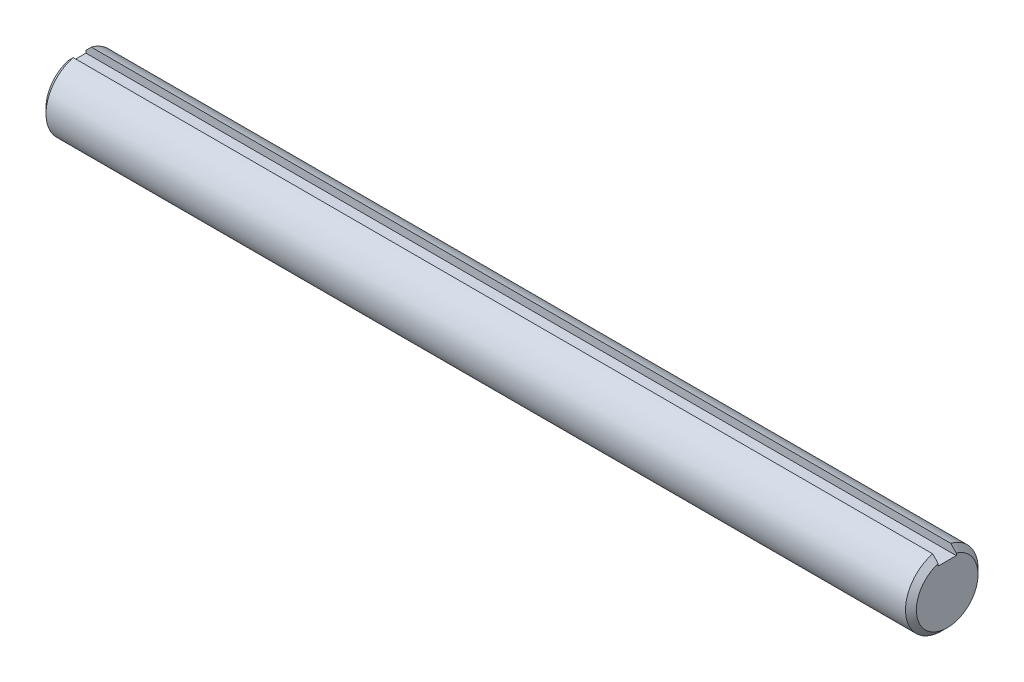
ISO-10303-21;
HEADER;
FILE_DESCRIPTION(('STEP AP214'),'2;1');
FILE_NAME('part.step','',(''),(''),'','','');
FILE_SCHEMA(('AUTOMOTIVE_DESIGN { 1 0 10303 214 1 1 1 1 }'));
ENDSEC;
DATA;
#1=APPLICATION_CONTEXT('core data for automotive mechanical design processes');
#2=APPLICATION_PROTOCOL_DEFINITION('international standard','automotive_design',2000,#1);
#3=PRODUCT_CONTEXT('',#1,'mechanical');
#4=PRODUCT('Part','Part','',(#3));
#5=PRODUCT_RELATED_PRODUCT_CATEGORY('part','',(#4));
#6=PRODUCT_DEFINITION_FORMATION('','',#4);
#7=PRODUCT_DEFINITION_CONTEXT('part definition',#1,'design');
#8=PRODUCT_DEFINITION('design','',#6,#7);
#9=PRODUCT_DEFINITION_SHAPE('','',#8);
#10=(LENGTH_UNIT() NAMED_UNIT(*) SI_UNIT(.MILLI.,.METRE.));
#11=(NAMED_UNIT(*) PLANE_ANGLE_UNIT() SI_UNIT($,.RADIAN.));
#12=(NAMED_UNIT(*) SI_UNIT($,.STERADIAN.) SOLID_ANGLE_UNIT());
#13=UNCERTAINTY_MEASURE_WITH_UNIT(LENGTH_MEASURE(1.E-05),#10,'distance_accuracy_value','');
#14=(GEOMETRIC_REPRESENTATION_CONTEXT(3) GLOBAL_UNCERTAINTY_ASSIGNED_CONTEXT((#13)) GLOBAL_UNIT_ASSIGNED_CONTEXT((#10,
#11,#12)) REPRESENTATION_CONTEXT('',''));
#15=CARTESIAN_POINT('',(0.,0.,0.));
#16=DIRECTION('',(0.,0.,1.));
#17=DIRECTION('',(1.,0.,0.));
#18=AXIS2_PLACEMENT_3D('',#15,#16,#17);
#19=CARTESIAN_POINT('',(152.4,0.,0.));
#20=DIRECTION('',(-1.,0.,0.));
#21=DIRECTION('',(0.,0.,1.));
#22=AXIS2_PLACEMENT_3D('',#19,#20,#21);
#23=CYLINDRICAL_SURFACE('',#22,12.7);
#24=CARTESIAN_POINT('',(150.495,0.,0.));
#25=DIRECTION('',(1.,0.,0.));
#26=DIRECTION('',(0.,0.,-1.));
#27=AXIS2_PLACEMENT_3D('',#24,#25,#26);
#28=CIRCLE('',#27,12.7);
#29=CARTESIAN_POINT('',(150.495,12.2967221242085,-3.17500000000001));
#30=VERTEX_POINT('',#29);
#31=CARTESIAN_POINT('',(150.495,12.2967221242085,3.17500000000001));
#32=VERTEX_POINT('',#31);
#33=EDGE_CURVE('E154',#30,#32,#28,.F.);
#34=ORIENTED_EDGE('',*,*,#33,.T.);
#35=DIRECTION('',(-1.,0.,0.));
#36=VECTOR('',#35,1.);
#37=CARTESIAN_POINT('',(152.4,12.2967221242085,3.17500000000001));
#38=LINE('',#37,#36);
#39=CARTESIAN_POINT('',(-150.495,12.2967221242085,3.17500000000001));
#40=VERTEX_POINT('',#39);
#41=EDGE_CURVE('E132',#32,#40,#38,.T.);
#42=ORIENTED_EDGE('',*,*,#41,.T.);
#43=CARTESIAN_POINT('',(-150.495,0.,0.));
#44=DIRECTION('',(1.,0.,0.));
#45=DIRECTION('',(0.,0.,-1.));
#46=AXIS2_PLACEMENT_3D('',#43,#44,#45);
#47=CIRCLE('',#46,12.7);
#48=CARTESIAN_POINT('',(-150.495,12.2967221242085,-3.17500000000001));
#49=VERTEX_POINT('',#48);
#50=EDGE_CURVE('E151',#40,#49,#47,.T.);
#51=ORIENTED_EDGE('',*,*,#50,.T.);
#52=DIRECTION('',(-1.,0.,0.));
#53=VECTOR('',#52,1.);
#54=CARTESIAN_POINT('',(152.4,12.2967221242085,-3.17500000000001));
#55=LINE('',#54,#53);
#56=EDGE_CURVE('E122',#49,#30,#55,.F.);
#57=ORIENTED_EDGE('',*,*,#56,.T.);
#58=EDGE_LOOP('',(#34,#42,#51,#57));
#59=FACE_BOUND('',#58,.T.);
#60=ADVANCED_FACE('F37',(#59),#23,.T.);
#61=CARTESIAN_POINT('',(152.4,0.,0.));
#62=DIRECTION('',(1.,0.,0.));
#63=DIRECTION('',(0.,0.,-1.));
#64=AXIS2_PLACEMENT_3D('',#61,#62,#63);
#65=PLANE('',#64);
#66=DIRECTION('',(0.,-1.,0.));
#67=VECTOR('',#66,1.);
#68=CARTESIAN_POINT('',(152.4,12.7,3.17500000000001));
#69=LINE('',#68,#67);
#70=CARTESIAN_POINT('',(152.4,10.3175287738877,3.17500000000001));
#71=VERTEX_POINT('',#70);
#72=CARTESIAN_POINT('',(152.4,9.525,3.17500000000001));
#73=VERTEX_POINT('',#72);
#74=EDGE_CURVE('E92',#71,#73,#69,.T.);
#75=ORIENTED_EDGE('',*,*,#74,.F.);
#76=CARTESIAN_POINT('',(152.4,0.,0.));
#77=DIRECTION('',(1.,0.,0.));
#78=DIRECTION('',(0.,0.,-1.));
#79=AXIS2_PLACEMENT_3D('',#76,#77,#78);
#80=CIRCLE('',#79,10.7950000000001);
#81=CARTESIAN_POINT('',(152.4,10.3175287738877,-3.17500000000001));
#82=VERTEX_POINT('',#81);
#83=EDGE_CURVE('E146',#71,#82,#80,.T.);
#84=ORIENTED_EDGE('',*,*,#83,.T.);
#85=DIRECTION('',(0.,1.,0.));
#86=VECTOR('',#85,1.);
#87=CARTESIAN_POINT('',(152.4,12.7,-3.17500000000001));
#88=LINE('',#87,#86);
#89=CARTESIAN_POINT('',(152.4,9.525,-3.17500000000001));
#90=VERTEX_POINT('',#89);
#91=EDGE_CURVE('E57',#90,#82,#88,.T.);
#92=ORIENTED_EDGE('',*,*,#91,.F.);
#93=DIRECTION('',(0.,0.,-1.));
#94=VECTOR('',#93,1.);
#95=CARTESIAN_POINT('',(152.4,9.525,3.17500000000001));
#96=LINE('',#95,#94);
#97=EDGE_CURVE('E102',#73,#90,#96,.T.);
#98=ORIENTED_EDGE('',*,*,#97,.F.);
#99=EDGE_LOOP('',(#75,#84,#92,#98));
#100=FACE_BOUND('',#99,.T.);
#101=ADVANCED_FACE('F113',(#100),#65,.T.);
#102=CARTESIAN_POINT('',(-152.4,0.,0.));
#103=DIRECTION('',(1.,0.,0.));
#104=DIRECTION('',(0.,0.,-1.));
#105=AXIS2_PLACEMENT_3D('',#102,#103,#104);
#106=PLANE('',#105);
#107=CARTESIAN_POINT('',(-152.4,0.,0.));
#108=DIRECTION('',(1.,0.,0.));
#109=DIRECTION('',(0.,0.,-1.));
#110=AXIS2_PLACEMENT_3D('',#107,#108,#109);
#111=CIRCLE('',#110,10.7949999999998);
#112=CARTESIAN_POINT('',(-152.4,10.3175287738874,-3.17500000000001));
#113=VERTEX_POINT('',#112);
#114=CARTESIAN_POINT('',(-152.4,10.3175287738874,3.17500000000001));
#115=VERTEX_POINT('',#114);
#116=EDGE_CURVE('E148',#113,#115,#111,.F.);
#117=ORIENTED_EDGE('',*,*,#116,.T.);
#118=DIRECTION('',(0.,-1.,0.));
#119=VECTOR('',#118,1.);
#120=CARTESIAN_POINT('',(-152.4,12.7,3.17500000000001));
#121=LINE('',#120,#119);
#122=CARTESIAN_POINT('',(-152.4,9.525,3.17500000000001));
#123=VERTEX_POINT('',#122);
#124=EDGE_CURVE('E115',#115,#123,#121,.T.);
#125=ORIENTED_EDGE('',*,*,#124,.T.);
#126=DIRECTION('',(0.,0.,-1.));
#127=VECTOR('',#126,1.);
#128=CARTESIAN_POINT('',(-152.4,9.525,3.17500000000001));
#129=LINE('',#128,#127);
#130=CARTESIAN_POINT('',(-152.4,9.525,-3.17500000000001));
#131=VERTEX_POINT('',#130);
#132=EDGE_CURVE('E108',#123,#131,#129,.T.);
#133=ORIENTED_EDGE('',*,*,#132,.T.);
#134=DIRECTION('',(0.,1.,0.));
#135=VECTOR('',#134,1.);
#136=CARTESIAN_POINT('',(-152.4,12.7,-3.17500000000001));
#137=LINE('',#136,#135);
#138=EDGE_CURVE('E111',#131,#113,#137,.T.);
#139=ORIENTED_EDGE('',*,*,#138,.T.);
#140=EDGE_LOOP('',(#117,#125,#133,#139));
#141=FACE_BOUND('',#140,.T.);
#142=ADVANCED_FACE('F165',(#141),#106,.F.);
#143=CARTESIAN_POINT('',(-150.495,0.,0.));
#144=DIRECTION('',(1.,0.,0.));
#145=DIRECTION('',(0.,0.,-1.));
#146=AXIS2_PLACEMENT_3D('',#143,#144,#145);
#147=CONICAL_SURFACE('',#146,12.7,0.785398163397451);
#148=CARTESIAN_POINT('',(-157.264196502013,5.0093717302407,3.17500000000001));
#149=CARTESIAN_POINT('',(-157.1667945387,5.12467963968378,3.17500000000001));
#150=CARTESIAN_POINT('',(-157.068842207621,5.23951989911784,3.17500000000001));
#151=CARTESIAN_POINT('',(-156.871992737128,5.46838421759484,3.17500000000001));
#152=CARTESIAN_POINT('',(-156.773095616323,5.58240829263705,3.17500000000001));
#153=CARTESIAN_POINT('',(-156.475230081458,5.92342458066591,3.17500000000001));
#154=CARTESIAN_POINT('',(-156.275072821867,6.14937813584766,3.17500000000001));
#155=CARTESIAN_POINT('',(-155.872467988588,6.59915683005551,3.17500000000001));
#156=CARTESIAN_POINT('',(-155.670020829871,6.82298234160729,3.17500000000001));
#157=CARTESIAN_POINT('',(-155.263355753249,7.26902629652594,3.17500000000001));
#158=CARTESIAN_POINT('',(-155.059137796434,7.49124470438244,3.17500000000001));
#159=CARTESIAN_POINT('',(-154.64938413778,7.93435772993712,3.17500000000001));
#160=CARTESIAN_POINT('',(-154.443848782028,8.15525266801075,3.17500000000001));
#161=CARTESIAN_POINT('',(-154.03169367339,8.5960245703693,3.17500000000001));
#162=CARTESIAN_POINT('',(-153.825073928935,8.81590154254229,3.17500000000001));
#163=CARTESIAN_POINT('',(-153.203892591144,9.47432927903637,3.17500000000001));
#164=CARTESIAN_POINT('',(-152.788030879735,9.91165318678529,3.17500000000001));
#165=CARTESIAN_POINT('',(-151.954096072104,10.7839479781506,3.17500000000001));
#166=CARTESIAN_POINT('',(-151.536023629402,11.2189194878173,3.17500000000001));
#167=CARTESIAN_POINT('',(-150.698229340112,12.0872516822017,3.17500000000001));
#168=CARTESIAN_POINT('',(-150.278507530402,12.5206124025178,3.17500000000001));
#169=CARTESIAN_POINT('',(-149.437764706775,13.3862448514882,3.17500000000001));
#170=CARTESIAN_POINT('',(-149.016743442379,13.8185163366833,3.17500000000001));
#171=CARTESIAN_POINT('',(-148.173758006437,14.682154105112,3.17500000000001));
#172=CARTESIAN_POINT('',(-147.751793818291,15.1135203721463,3.17500000000001));
#173=CARTESIAN_POINT('',(-147.329500629925,15.5445632058881,3.17500000000001));
#174=B_SPLINE_CURVE_WITH_KNOTS('',3,(#148,#149,#150,#151,#152,#153,#154,#155,#156,#157,#158,
#159,#160,#161,#162,#163,#164,#165,#166,#167,#168,#169,#170,#171,#172,#173),.UNSPECIFIED.,.F.,
.F.,(4,2,2,2,2,2,2,2,2,2,2,2,4),(0.,0.452816810908755,0.905624721024864,1.81117254191706,
2.71655880973217,3.62196502210454,4.52714240548241,5.43231276298766,7.24275040676511,
9.05267984842248,10.8625690499397,12.6728321405143,14.4831273549283),.UNSPECIFIED.);
#175=EDGE_CURVE('E65',#115,#40,#174,.T.);
#176=ORIENTED_EDGE('',*,*,#175,.F.);
#177=ORIENTED_EDGE('',*,*,#116,.F.);
#178=CARTESIAN_POINT('',(-147.329500629925,15.5445632058881,-3.17500000000001));
#179=CARTESIAN_POINT('',(-147.751793818291,15.1135203721463,-3.17500000000001));
#180=CARTESIAN_POINT('',(-148.173758006437,14.682154105112,-3.17500000000001));
#181=CARTESIAN_POINT('',(-149.016743442379,13.8185163366833,-3.17500000000001));
#182=CARTESIAN_POINT('',(-149.437764706775,13.3862448514882,-3.17500000000001));
#183=CARTESIAN_POINT('',(-150.278507530402,12.5206124025178,-3.17500000000001));
#184=CARTESIAN_POINT('',(-150.698229340112,12.0872516822017,-3.17500000000001));
#185=CARTESIAN_POINT('',(-151.536023629402,11.2189194878173,-3.17500000000001));
#186=CARTESIAN_POINT('',(-151.954096072104,10.7839479781506,-3.17500000000001));
#187=CARTESIAN_POINT('',(-152.788030879735,9.91165318678528,-3.17500000000001));
#188=CARTESIAN_POINT('',(-153.203892591144,9.47432927903637,-3.17500000000001));
#189=CARTESIAN_POINT('',(-153.825073928935,8.81590154254229,-3.17500000000001));
#190=CARTESIAN_POINT('',(-154.03169367339,8.59602457036929,-3.17500000000001));
#191=CARTESIAN_POINT('',(-154.443848782028,8.15525266801075,-3.17500000000001));
#192=CARTESIAN_POINT('',(-154.64938413778,7.93435772993713,-3.17500000000001));
#193=CARTESIAN_POINT('',(-155.059137796434,7.49124470438244,-3.17500000000001));
#194=CARTESIAN_POINT('',(-155.263355753249,7.26902629652593,-3.17500000000001));
#195=CARTESIAN_POINT('',(-155.670020829871,6.82298234160728,-3.17500000000001));
#196=CARTESIAN_POINT('',(-155.872467988588,6.5991568300555,-3.17500000000001));
#197=CARTESIAN_POINT('',(-156.275072821867,6.14937813584767,-3.17500000000001));
#198=CARTESIAN_POINT('',(-156.475230081458,5.92342458066593,-3.17500000000001));
#199=CARTESIAN_POINT('',(-156.773095616323,5.58240829263707,-3.17500000000001));
#200=CARTESIAN_POINT('',(-156.871992737128,5.46838421759485,-3.17500000000001));
#201=CARTESIAN_POINT('',(-157.068842207621,5.23951989911783,-3.17500000000001));
#202=CARTESIAN_POINT('',(-157.1667945387,5.12467963968377,-3.17500000000001));
#203=CARTESIAN_POINT('',(-157.264196502013,5.0093717302407,-3.17500000000001));
#204=B_SPLINE_CURVE_WITH_KNOTS('',3,(#178,#179,#180,#181,#182,#183,#184,#185,#186,#187,#188,
#189,#190,#191,#192,#193,#194,#195,#196,#197,#198,#199,#200,#201,#202,#203),.UNSPECIFIED.,.F.,
.F.,(4,2,2,2,2,2,2,2,2,2,2,2,4),(0.,1.81029521441401,3.62055830498866,5.43044750650589,
7.24037694816321,9.05081459194065,9.9559849494459,10.8611623328238,11.7665685451962,
12.6719548130113,13.5775026339034,14.0303105440196,14.4831273549283),.UNSPECIFIED.);
#205=EDGE_CURVE('E126',#49,#113,#204,.T.);
#206=ORIENTED_EDGE('',*,*,#205,.F.);
#207=ORIENTED_EDGE('',*,*,#50,.F.);
#208=EDGE_LOOP('',(#176,#177,#206,#207));
#209=FACE_BOUND('',#208,.T.);
#210=ADVANCED_FACE('F134',(#209),#147,.T.);
#211=CARTESIAN_POINT('',(152.4,0.,0.));
#212=DIRECTION('',(-1.,0.,0.));
#213=DIRECTION('',(0.,0.,1.));
#214=AXIS2_PLACEMENT_3D('',#211,#212,#213);
#215=CONICAL_SURFACE('',#214,10.7950000000001,0.785398163397451);
#216=CARTESIAN_POINT('',(147.329500629925,15.5445632058881,3.17500000000001));
#217=CARTESIAN_POINT('',(147.751793818292,15.1135203721463,3.17500000000001));
#218=CARTESIAN_POINT('',(148.173758006437,14.682154105112,3.17500000000001));
#219=CARTESIAN_POINT('',(149.016743442379,13.8185163366833,3.17500000000001));
#220=CARTESIAN_POINT('',(149.437764706775,13.3862448514883,3.17500000000001));
#221=CARTESIAN_POINT('',(150.278507530402,12.5206124025179,3.17500000000001));
#222=CARTESIAN_POINT('',(150.698229340112,12.0872516822018,3.17500000000001));
#223=CARTESIAN_POINT('',(151.536023629403,11.2189194878174,3.17500000000001));
#224=CARTESIAN_POINT('',(151.954096072104,10.7839479781507,3.17500000000001));
#225=CARTESIAN_POINT('',(152.788030879735,9.91165318678542,3.17500000000001));
#226=CARTESIAN_POINT('',(153.203892591145,9.47432927903652,3.17500000000001));
#227=CARTESIAN_POINT('',(153.825073928935,8.81590154254246,3.17500000000001));
#228=CARTESIAN_POINT('',(154.03169367339,8.59602457036948,3.17500000000001));
#229=CARTESIAN_POINT('',(154.443848782028,8.15525266801094,3.17500000000001));
#230=CARTESIAN_POINT('',(154.64938413778,7.93435772993732,3.17500000000001));
#231=CARTESIAN_POINT('',(155.059137796434,7.49124470438264,3.17500000000001));
#232=CARTESIAN_POINT('',(155.263355753249,7.26902629652615,3.17500000000001));
#233=CARTESIAN_POINT('',(155.670020829871,6.82298234160751,3.17500000000001));
#234=CARTESIAN_POINT('',(155.872467988588,6.59915683005575,3.17500000000001));
#235=CARTESIAN_POINT('',(156.275072821867,6.14937813584791,3.17500000000001));
#236=CARTESIAN_POINT('',(156.475230081458,5.92342458066616,3.17500000000001));
#237=CARTESIAN_POINT('',(156.773095616323,5.58240829263731,3.17500000000001));
#238=CARTESIAN_POINT('',(156.871992737128,5.4683842175951,3.17500000000001));
#239=CARTESIAN_POINT('',(157.068842207621,5.2395198991181,3.17500000000001));
#240=CARTESIAN_POINT('',(157.1667945387,5.12467963968404,3.17500000000001));
#241=CARTESIAN_POINT('',(157.264196502013,5.00937173024095,3.17500000000001));
#242=B_SPLINE_CURVE_WITH_KNOTS('',3,(#216,#217,#218,#219,#220,#221,#222,#223,#224,#225,#226,
#227,#228,#229,#230,#231,#232,#233,#234,#235,#236,#237,#238,#239,#240,#241),.UNSPECIFIED.,.F.,
.F.,(4,2,2,2,2,2,2,2,2,2,2,2,4),(0.,1.81029521441396,3.62055830498858,5.4304475065057,
7.24037694816304,9.05081459194041,9.95598494944562,10.8611623328235,11.7665685451958,
12.6719548130109,13.5775026339031,14.0303105440192,14.483127354928),.UNSPECIFIED.);
#243=EDGE_CURVE('E11',#32,#71,#242,.T.);
#244=ORIENTED_EDGE('',*,*,#243,.F.);
#245=ORIENTED_EDGE('',*,*,#33,.F.);
#246=CARTESIAN_POINT('',(157.264196502013,5.00937173024095,-3.17500000000001));
#247=CARTESIAN_POINT('',(157.1667945387,5.12467963968403,-3.17500000000001));
#248=CARTESIAN_POINT('',(157.068842207621,5.23951989911808,-3.17500000000001));
#249=CARTESIAN_POINT('',(156.871992737128,5.46838421759509,-3.17500000000001));
#250=CARTESIAN_POINT('',(156.773095616323,5.5824082926373,-3.17500000000001));
#251=CARTESIAN_POINT('',(156.475230081458,5.92342458066616,-3.17500000000001));
#252=CARTESIAN_POINT('',(156.275072821867,6.1493781358479,-3.17500000000001));
#253=CARTESIAN_POINT('',(155.872467988588,6.59915683005573,-3.17500000000001));
#254=CARTESIAN_POINT('',(155.670020829871,6.8229823416075,-3.17500000000001));
#255=CARTESIAN_POINT('',(155.263355753249,7.26902629652614,-3.17500000000001));
#256=CARTESIAN_POINT('',(155.059137796434,7.49124470438263,-3.17500000000001));
#257=CARTESIAN_POINT('',(154.64938413778,7.9343577299373,-3.17500000000001));
#258=CARTESIAN_POINT('',(154.443848782028,8.15525266801093,-3.17500000000001));
#259=CARTESIAN_POINT('',(154.03169367339,8.59602457036947,-3.17500000000001));
#260=CARTESIAN_POINT('',(153.825073928935,8.81590154254246,-3.17500000000001));
#261=CARTESIAN_POINT('',(153.203892591145,9.47432927903651,-3.17500000000001));
#262=CARTESIAN_POINT('',(152.788030879735,9.91165318678542,-3.17500000000001));
#263=CARTESIAN_POINT('',(151.954096072104,10.7839479781507,-3.17500000000001));
#264=CARTESIAN_POINT('',(151.536023629403,11.2189194878174,-3.17500000000001));
#265=CARTESIAN_POINT('',(150.698229340112,12.0872516822017,-3.17500000000001));
#266=CARTESIAN_POINT('',(150.278507530402,12.5206124025179,-3.17500000000001));
#267=CARTESIAN_POINT('',(149.437764706775,13.3862448514883,-3.17500000000001));
#268=CARTESIAN_POINT('',(149.016743442379,13.8185163366833,-3.17500000000001));
#269=CARTESIAN_POINT('',(148.173758006437,14.682154105112,-3.17500000000001));
#270=CARTESIAN_POINT('',(147.751793818292,15.1135203721463,-3.17500000000001));
#271=CARTESIAN_POINT('',(147.329500629925,15.5445632058881,-3.17500000000001));
#272=B_SPLINE_CURVE_WITH_KNOTS('',3,(#246,#247,#248,#249,#250,#251,#252,#253,#254,#255,#256,
#257,#258,#259,#260,#261,#262,#263,#264,#265,#266,#267,#268,#269,#270,#271),.UNSPECIFIED.,.F.,
.F.,(4,2,2,2,2,2,2,2,2,2,2,2,4),(0.,0.452816810908744,0.905624721024838,1.81117254191701,
2.71655880973209,3.62196502210445,4.52714240548231,5.43231276298756,7.24275040676492,
9.05267984842222,10.8625690499394,12.672832140514,14.4831273549279),.UNSPECIFIED.);
#273=EDGE_CURVE('E50',#82,#30,#272,.T.);
#274=ORIENTED_EDGE('',*,*,#273,.F.);
#275=ORIENTED_EDGE('',*,*,#83,.F.);
#276=EDGE_LOOP('',(#244,#245,#274,#275));
#277=FACE_BOUND('',#276,.T.);
#278=ADVANCED_FACE('F39',(#277),#215,.T.);
#279=CARTESIAN_POINT('',(-152.4,12.7,3.17500000000001));
#280=DIRECTION('',(0.,0.,1.));
#281=DIRECTION('',(1.,0.,0.));
#282=AXIS2_PLACEMENT_3D('',#279,#280,#281);
#283=PLANE('',#282);
#284=ORIENTED_EDGE('',*,*,#175,.T.);
#285=ORIENTED_EDGE('',*,*,#41,.F.);
#286=ORIENTED_EDGE('',*,*,#243,.T.);
#287=ORIENTED_EDGE('',*,*,#74,.T.);
#288=DIRECTION('',(1.,0.,0.));
#289=VECTOR('',#288,1.);
#290=CARTESIAN_POINT('',(-152.4,9.525,3.17500000000001));
#291=LINE('',#290,#289);
#292=EDGE_CURVE('E95',#123,#73,#291,.T.);
#293=ORIENTED_EDGE('',*,*,#292,.F.);
#294=ORIENTED_EDGE('',*,*,#124,.F.);
#295=EDGE_LOOP('',(#284,#285,#286,#287,#293,#294));
#296=FACE_BOUND('',#295,.T.);
#297=ADVANCED_FACE('F94',(#296),#283,.F.);
#298=CARTESIAN_POINT('',(-152.4,12.7,-3.17500000000001));
#299=DIRECTION('',(0.,0.,-1.));
#300=DIRECTION('',(-1.,0.,0.));
#301=AXIS2_PLACEMENT_3D('',#298,#299,#300);
#302=PLANE('',#301);
#303=ORIENTED_EDGE('',*,*,#205,.T.);
#304=ORIENTED_EDGE('',*,*,#138,.F.);
#305=DIRECTION('',(1.,0.,0.));
#306=VECTOR('',#305,1.);
#307=CARTESIAN_POINT('',(-152.4,9.525,-3.17500000000001));
#308=LINE('',#307,#306);
#309=EDGE_CURVE('E110',#131,#90,#308,.T.);
#310=ORIENTED_EDGE('',*,*,#309,.T.);
#311=ORIENTED_EDGE('',*,*,#91,.T.);
#312=ORIENTED_EDGE('',*,*,#273,.T.);
#313=ORIENTED_EDGE('',*,*,#56,.F.);
#314=EDGE_LOOP('',(#303,#304,#310,#311,#312,#313));
#315=FACE_BOUND('',#314,.T.);
#316=ADVANCED_FACE('F137',(#315),#302,.F.);
#317=CARTESIAN_POINT('',(-152.4,9.525,3.17500000000001));
#318=DIRECTION('',(0.,-1.,0.));
#319=DIRECTION('',(0.,0.,-1.));
#320=AXIS2_PLACEMENT_3D('',#317,#318,#319);
#321=PLANE('',#320);
#322=ORIENTED_EDGE('',*,*,#309,.F.);
#323=ORIENTED_EDGE('',*,*,#132,.F.);
#324=ORIENTED_EDGE('',*,*,#292,.T.);
#325=ORIENTED_EDGE('',*,*,#97,.T.);
#326=EDGE_LOOP('',(#322,#323,#324,#325));
#327=FACE_BOUND('',#326,.T.);
#328=ADVANCED_FACE('F106',(#327),#321,.F.);
#329=CLOSED_SHELL('',(#60,#101,#142,#210,#278,#297,#316,#328));
#330=MANIFOLD_SOLID_BREP('B2',#329);
#331=ADVANCED_BREP_SHAPE_REPRESENTATION('',(#18,#330),#14);
#332=SHAPE_DEFINITION_REPRESENTATION(#9,#331);
ENDSEC;
END-ISO-10303-21;
